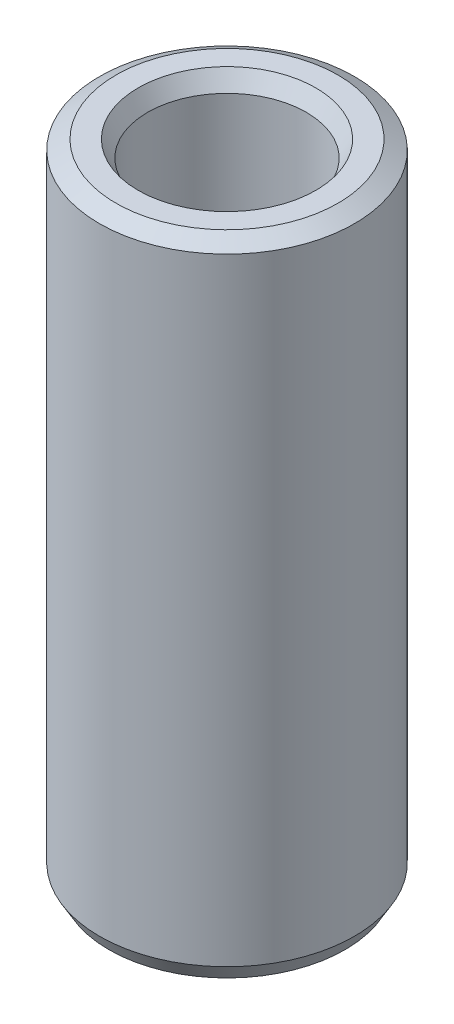
ISO-10303-21;
HEADER;
FILE_DESCRIPTION(('STEP AP214'),'2;1');
FILE_NAME('part.step','',(''),(''),'','','');
FILE_SCHEMA(('AUTOMOTIVE_DESIGN { 1 0 10303 214 1 1 1 1 }'));
ENDSEC;
DATA;
#1=APPLICATION_CONTEXT('core data for automotive mechanical design processes');
#2=APPLICATION_PROTOCOL_DEFINITION('international standard','automotive_design',2000,#1);
#3=PRODUCT_CONTEXT('',#1,'mechanical');
#4=PRODUCT('Part','Part','',(#3));
#5=PRODUCT_RELATED_PRODUCT_CATEGORY('part','',(#4));
#6=PRODUCT_DEFINITION_FORMATION('','',#4);
#7=PRODUCT_DEFINITION_CONTEXT('part definition',#1,'design');
#8=PRODUCT_DEFINITION('design','',#6,#7);
#9=PRODUCT_DEFINITION_SHAPE('','',#8);
#10=(LENGTH_UNIT() NAMED_UNIT(*) SI_UNIT(.MILLI.,.METRE.));
#11=(NAMED_UNIT(*) PLANE_ANGLE_UNIT() SI_UNIT($,.RADIAN.));
#12=(NAMED_UNIT(*) SI_UNIT($,.STERADIAN.) SOLID_ANGLE_UNIT());
#13=UNCERTAINTY_MEASURE_WITH_UNIT(LENGTH_MEASURE(1.E-05),#10,'distance_accuracy_value','');
#14=(GEOMETRIC_REPRESENTATION_CONTEXT(3) GLOBAL_UNCERTAINTY_ASSIGNED_CONTEXT((#13)) GLOBAL_UNIT_ASSIGNED_CONTEXT((#10,
#11,#12)) REPRESENTATION_CONTEXT('',''));
#15=CARTESIAN_POINT('',(0.,0.,0.));
#16=DIRECTION('',(0.,0.,1.));
#17=DIRECTION('',(1.,0.,0.));
#18=AXIS2_PLACEMENT_3D('',#15,#16,#17);
#19=CARTESIAN_POINT('',(0.,252.18787916316,0.));
#20=DIRECTION('',(0.,-1.,0.));
#21=DIRECTION('',(0.,0.,-1.));
#22=AXIS2_PLACEMENT_3D('',#19,#20,#21);
#23=CYLINDRICAL_SURFACE('',#22,50.);
#24=CARTESIAN_POINT('',(0.,6.446711451987,0.));
#25=DIRECTION('',(0.,1.,0.));
#26=DIRECTION('',(0.,0.,1.));
#27=AXIS2_PLACEMENT_3D('',#24,#25,#26);
#28=CIRCLE('',#27,50.);
#29=CARTESIAN_POINT('',(0.,6.446711451987,50.));
#30=VERTEX_POINT('',#29);
#31=EDGE_CURVE('E10',#30,#30,#28,.T.);
#32=ORIENTED_EDGE('',*,*,#31,.T.);
#33=EDGE_LOOP('',(#32));
#34=FACE_BOUND('',#33,.T.);
#35=CARTESIAN_POINT('',(0.,248.465868570967,0.));
#36=DIRECTION('',(0.,1.,0.));
#37=DIRECTION('',(0.,0.,1.));
#38=AXIS2_PLACEMENT_3D('',#35,#36,#37);
#39=CIRCLE('',#38,50.);
#40=CARTESIAN_POINT('',(0.,248.465868570967,-50.));
#41=VERTEX_POINT('',#40);
#42=EDGE_CURVE('E50',#41,#41,#39,.F.);
#43=ORIENTED_EDGE('',*,*,#42,.T.);
#44=EDGE_LOOP('',(#43));
#45=FACE_BOUND('',#44,.T.);
#46=ADVANCED_FACE('F39',(#34,#45),#23,.T.);
#47=CARTESIAN_POINT('',(0.,252.18787916316,0.));
#48=DIRECTION('',(0.,1.,0.));
#49=DIRECTION('',(0.,0.,1.));
#50=AXIS2_PLACEMENT_3D('',#47,#48,#49);
#51=PLANE('',#50);
#52=CARTESIAN_POINT('',(0.,252.18787916316,0.));
#53=DIRECTION('',(0.,1.,0.));
#54=DIRECTION('',(0.,0.,1.));
#55=AXIS2_PLACEMENT_3D('',#52,#53,#54);
#56=CIRCLE('',#55,34.8376289305823);
#57=CARTESIAN_POINT('',(0.,252.18787916316,34.8376289305823));
#58=VERTEX_POINT('',#57);
#59=EDGE_CURVE('E58',#58,#58,#56,.F.);
#60=ORIENTED_EDGE('',*,*,#59,.T.);
#61=EDGE_LOOP('',(#60));
#62=FACE_BOUND('',#61,.T.);
#63=CARTESIAN_POINT('',(0.,252.18787916316,0.));
#64=DIRECTION('',(0.,1.,0.));
#65=DIRECTION('',(0.,0.,1.));
#66=AXIS2_PLACEMENT_3D('',#63,#64,#65);
#67=CIRCLE('',#66,43.553288548013);
#68=CARTESIAN_POINT('',(0.,252.18787916316,-43.553288548013));
#69=VERTEX_POINT('',#68);
#70=EDGE_CURVE('E61',#69,#69,#67,.T.);
#71=ORIENTED_EDGE('',*,*,#70,.T.);
#72=EDGE_LOOP('',(#71));
#73=FACE_BOUND('',#72,.T.);
#74=ADVANCED_FACE('F88',(#62,#73),#51,.T.);
#75=CARTESIAN_POINT('',(0.,0.,0.));
#76=DIRECTION('',(0.,1.,0.));
#77=DIRECTION('',(0.,0.,1.));
#78=AXIS2_PLACEMENT_3D('',#75,#76,#77);
#79=PLANE('',#78);
#80=CARTESIAN_POINT('',(0.,0.,0.));
#81=DIRECTION('',(0.,1.,0.));
#82=DIRECTION('',(0.,0.,1.));
#83=AXIS2_PLACEMENT_3D('',#80,#81,#82);
#84=CIRCLE('',#83,37.5623297903769);
#85=CARTESIAN_POINT('',(0.,0.,37.5623297903769));
#86=VERTEX_POINT('',#85);
#87=EDGE_CURVE('E51',#86,#86,#84,.T.);
#88=ORIENTED_EDGE('',*,*,#87,.T.);
#89=EDGE_LOOP('',(#88));
#90=FACE_BOUND('',#89,.T.);
#91=CARTESIAN_POINT('',(0.,0.,0.));
#92=DIRECTION('',(0.,1.,0.));
#93=DIRECTION('',(0.,0.,1.));
#94=AXIS2_PLACEMENT_3D('',#91,#92,#93);
#95=CIRCLE('',#94,46.2779894078074);
#96=CARTESIAN_POINT('',(0.,0.,46.2779894078074));
#97=VERTEX_POINT('',#96);
#98=EDGE_CURVE('E54',#97,#97,#95,.F.);
#99=ORIENTED_EDGE('',*,*,#98,.T.);
#100=EDGE_LOOP('',(#99));
#101=FACE_BOUND('',#100,.T.);
#102=ADVANCED_FACE('F83',(#90,#101),#79,.F.);
#103=CARTESIAN_POINT('',(0.,252.18787916316,0.));
#104=DIRECTION('',(0.,-1.,0.));
#105=DIRECTION('',(0.,0.,-1.));
#106=AXIS2_PLACEMENT_3D('',#103,#104,#105);
#107=CYLINDRICAL_SURFACE('',#106,31.1156183383899);
#108=CARTESIAN_POINT('',(0.,245.741167711173,0.));
#109=DIRECTION('',(0.,1.,0.));
#110=DIRECTION('',(0.,0.,1.));
#111=AXIS2_PLACEMENT_3D('',#108,#109,#110);
#112=CIRCLE('',#111,31.1156183383899);
#113=CARTESIAN_POINT('',(0.,245.741167711173,31.1156183383899));
#114=VERTEX_POINT('',#113);
#115=EDGE_CURVE('E67',#114,#114,#112,.T.);
#116=ORIENTED_EDGE('',*,*,#115,.T.);
#117=EDGE_LOOP('',(#116));
#118=FACE_BOUND('',#117,.T.);
#119=CARTESIAN_POINT('',(0.,3.72201059219263,0.));
#120=DIRECTION('',(0.,1.,0.));
#121=DIRECTION('',(0.,0.,1.));
#122=AXIS2_PLACEMENT_3D('',#119,#120,#121);
#123=CIRCLE('',#122,31.1156183383899);
#124=CARTESIAN_POINT('',(0.,3.72201059219263,31.1156183383899));
#125=VERTEX_POINT('',#124);
#126=EDGE_CURVE('E69',#125,#125,#123,.F.);
#127=ORIENTED_EDGE('',*,*,#126,.T.);
#128=EDGE_LOOP('',(#127));
#129=FACE_BOUND('',#128,.T.);
#130=ADVANCED_FACE('F71',(#118,#129),#107,.F.);
#131=CARTESIAN_POINT('',(0.,245.741167711173,0.));
#132=DIRECTION('',(0.,1.,0.));
#133=DIRECTION('',(0.,0.,1.));
#134=AXIS2_PLACEMENT_3D('',#131,#132,#133);
#135=CONICAL_SURFACE('',#134,31.1156183383899,0.523598775598296);
#136=ORIENTED_EDGE('',*,*,#59,.F.);
#137=EDGE_LOOP('',(#136));
#138=FACE_BOUND('',#137,.T.);
#139=ORIENTED_EDGE('',*,*,#115,.F.);
#140=EDGE_LOOP('',(#139));
#141=FACE_BOUND('',#140,.T.);
#142=ADVANCED_FACE('F77',(#138,#141),#135,.F.);
#143=CARTESIAN_POINT('',(0.,0.,0.));
#144=DIRECTION('',(0.,-1.,0.));
#145=DIRECTION('',(0.,0.,-1.));
#146=AXIS2_PLACEMENT_3D('',#143,#144,#145);
#147=CONICAL_SURFACE('',#146,37.5623297903769,1.04719755119659);
#148=ORIENTED_EDGE('',*,*,#126,.F.);
#149=EDGE_LOOP('',(#148));
#150=FACE_BOUND('',#149,.T.);
#151=ORIENTED_EDGE('',*,*,#87,.F.);
#152=EDGE_LOOP('',(#151));
#153=FACE_BOUND('',#152,.T.);
#154=ADVANCED_FACE('F73',(#150,#153),#147,.F.);
#155=CARTESIAN_POINT('',(0.,6.446711451987,0.));
#156=DIRECTION('',(0.,1.,0.));
#157=DIRECTION('',(0.,0.,1.));
#158=AXIS2_PLACEMENT_3D('',#155,#156,#157);
#159=CONICAL_SURFACE('',#158,50.,0.523598775598304);
#160=ORIENTED_EDGE('',*,*,#98,.F.);
#161=EDGE_LOOP('',(#160));
#162=FACE_BOUND('',#161,.T.);
#163=ORIENTED_EDGE('',*,*,#31,.F.);
#164=EDGE_LOOP('',(#163));
#165=FACE_BOUND('',#164,.T.);
#166=ADVANCED_FACE('F76',(#162,#165),#159,.T.);
#167=CARTESIAN_POINT('',(0.,252.18787916316,0.));
#168=DIRECTION('',(0.,-1.,0.));
#169=DIRECTION('',(0.,0.,-1.));
#170=AXIS2_PLACEMENT_3D('',#167,#168,#169);
#171=CONICAL_SURFACE('',#170,43.553288548013,1.0471975511966);
#172=CARTESIAN_POINT('',(0.,248.465868570967,-50.));
#173=CARTESIAN_POINT('',(0.,248.504639514636,-49.9328467557085));
#174=CARTESIAN_POINT('',(0.,248.543410458305,-49.865693511417));
#175=CARTESIAN_POINT('',(0.,248.620952345642,-49.7313870228339));
#176=CARTESIAN_POINT('',(0.,248.659723289311,-49.6642337785424));
#177=CARTESIAN_POINT('',(0.,248.737265176648,-49.5299272899593));
#178=CARTESIAN_POINT('',(0.,248.776036120317,-49.4627740456678));
#179=CARTESIAN_POINT('',(0.,248.853578007654,-49.3284675570847));
#180=CARTESIAN_POINT('',(0.,248.892348951323,-49.2613143127932));
#181=CARTESIAN_POINT('',(0.,248.96989083866,-49.1270078242101));
#182=CARTESIAN_POINT('',(0.,249.008661782329,-49.0598545799186));
#183=CARTESIAN_POINT('',(0.,249.086203669666,-48.9255480913355));
#184=CARTESIAN_POINT('',(0.,249.124974613335,-48.858394847044));
#185=CARTESIAN_POINT('',(0.,249.202516500672,-48.7240883584609));
#186=CARTESIAN_POINT('',(0.,249.241287444341,-48.6569351141694));
#187=CARTESIAN_POINT('',(0.,249.318829331678,-48.5226286255863));
#188=CARTESIAN_POINT('',(0.,249.357600275347,-48.4554753812948));
#189=CARTESIAN_POINT('',(0.,249.435142162684,-48.3211688927117));
#190=CARTESIAN_POINT('',(0.,249.473913106353,-48.2540156484202));
#191=CARTESIAN_POINT('',(0.,249.55145499369,-48.1197091598372));
#192=CARTESIAN_POINT('',(0.,249.590225937359,-48.0525559155456));
#193=CARTESIAN_POINT('',(0.,249.667767824696,-47.9182494269626));
#194=CARTESIAN_POINT('',(0.,249.706538768365,-47.851096182671));
#195=CARTESIAN_POINT('',(0.,249.784080655702,-47.716789694088));
#196=CARTESIAN_POINT('',(0.,249.822851599371,-47.6496364497964));
#197=CARTESIAN_POINT('',(0.,249.900393486708,-47.5153299612134));
#198=CARTESIAN_POINT('',(0.,249.939164430377,-47.4481767169218));
#199=CARTESIAN_POINT('',(0.,250.016706317714,-47.3138702283388));
#200=CARTESIAN_POINT('',(0.,250.055477261383,-47.2467169840473));
#201=CARTESIAN_POINT('',(0.,250.13301914872,-47.1124104954642));
#202=CARTESIAN_POINT('',(0.,250.171790092389,-47.0452572511727));
#203=CARTESIAN_POINT('',(0.,250.249331979726,-46.9109507625896));
#204=CARTESIAN_POINT('',(0.,250.288102923395,-46.8437975182981));
#205=CARTESIAN_POINT('',(0.,250.365644810732,-46.709491029715));
#206=CARTESIAN_POINT('',(0.,250.404415754401,-46.6423377854235));
#207=CARTESIAN_POINT('',(0.,250.481957641738,-46.5080312968404));
#208=CARTESIAN_POINT('',(0.,250.520728585407,-46.4408780525489));
#209=CARTESIAN_POINT('',(0.,250.598270472744,-46.3065715639658));
#210=CARTESIAN_POINT('',(0.,250.637041416413,-46.2394183196743));
#211=CARTESIAN_POINT('',(0.,250.71458330375,-46.1051118310912));
#212=CARTESIAN_POINT('',(0.,250.753354247419,-46.0379585867997));
#213=CARTESIAN_POINT('',(0.,250.830896134756,-45.9036520982166));
#214=CARTESIAN_POINT('',(0.,250.869667078425,-45.8364988539251));
#215=CARTESIAN_POINT('',(0.,250.947208965762,-45.702192365342));
#216=CARTESIAN_POINT('',(0.,250.985979909431,-45.6350391210505));
#217=CARTESIAN_POINT('',(0.,251.063521796768,-45.5007326324674));
#218=CARTESIAN_POINT('',(0.,251.102292740437,-45.4335793881759));
#219=CARTESIAN_POINT('',(0.,251.179834627774,-45.2992728995929));
#220=CARTESIAN_POINT('',(0.,251.218605571443,-45.2321196553013));
#221=CARTESIAN_POINT('',(0.,251.29614745878,-45.0978131667183));
#222=CARTESIAN_POINT('',(0.,251.334918402449,-45.0306599224267));
#223=CARTESIAN_POINT('',(0.,251.412460289786,-44.8963534338437));
#224=CARTESIAN_POINT('',(0.,251.451231233455,-44.8292001895521));
#225=CARTESIAN_POINT('',(0.,251.528773120792,-44.6948937009691));
#226=CARTESIAN_POINT('',(0.,251.567544064461,-44.6277404566775));
#227=CARTESIAN_POINT('',(0.,251.645085951798,-44.4934339680945));
#228=CARTESIAN_POINT('',(0.,251.683856895467,-44.4262807238029));
#229=CARTESIAN_POINT('',(0.,251.761398782804,-44.2919742352199));
#230=CARTESIAN_POINT('',(0.,251.800169726473,-44.2248209909283));
#231=CARTESIAN_POINT('',(0.,251.87771161381,-44.0905145023453));
#232=CARTESIAN_POINT('',(0.,251.916482557479,-44.0233612580538));
#233=CARTESIAN_POINT('',(0.,251.994024444816,-43.8890547694707));
#234=CARTESIAN_POINT('',(0.,252.032795388485,-43.8219015251792));
#235=CARTESIAN_POINT('',(0.,252.110337275822,-43.6875950365961));
#236=CARTESIAN_POINT('',(0.,252.149108219491,-43.6204417923046));
#237=CARTESIAN_POINT('',(0.,252.18787916316,-43.553288548013));
#238=B_SPLINE_CURVE_WITH_KNOTS('',3,(#172,#173,#174,#175,#176,#177,#178,#179,#180,#181,#182,
#183,#184,#185,#186,#187,#188,#189,#190,#191,#192,#193,#194,#195,#196,#197,#198,#199,#200,#201,
#202,#203,#204,#205,#206,#207,#208,#209,#210,#211,#212,#213,#214,#215,#216,#217,#218,#219,#220,
#221,#222,#223,#224,#225,#226,#227,#228,#229,#230,#231,#232,#233,#234,#235,#236,#237),
.UNSPECIFIED.,.F.,.F.,(4,2,2,2,2,2,2,2,2,2,2,2,2,2,2,2,2,2,2,2,2,2,2,2,2,2,2,2,2,2,2,2,4),(0.,
0.232625662012023,0.465251324024061,0.697876986036098,0.930502648048129,1.16312831006017,
1.39575397207219,1.62837963408422,1.86100529609626,2.0936309581083,2.32625662012033,
2.55888228213237,2.79150794414439,3.02413360615643,3.25675926816846,3.48938493018048,
3.72201059219253,3.95463625420456,4.1872619162166,4.41988757822862,4.65251324024068,
4.88513890225269,5.11776456426472,5.35039022627677,5.58301588828878,5.81564155030084,
6.04826721231286,6.28089287432488,6.51351853633693,6.74614419834895,6.978769860361,
7.21139552237302,7.44402118438507),.UNSPECIFIED.);
#239=EDGE_CURVE('BSEAM45',#41,#69,#238,.T.);
#240=ORIENTED_EDGE('',*,*,#42,.F.);
#241=ORIENTED_EDGE('',*,*,#70,.F.);
#242=ORIENTED_EDGE('',*,*,#239,.T.);
#243=ORIENTED_EDGE('',*,*,#239,.F.);
#244=EDGE_LOOP('',(#240,#242,#241,#243));
#245=FACE_BOUND('',#244,.T.);
#246=ADVANCED_FACE('F45',(#245),#171,.T.);
#247=CLOSED_SHELL('',(#46,#74,#102,#130,#142,#154,#166,#246));
#248=MANIFOLD_SOLID_BREP('B2',#247);
#249=ADVANCED_BREP_SHAPE_REPRESENTATION('',(#18,#248),#14);
#250=SHAPE_DEFINITION_REPRESENTATION(#9,#249);
ENDSEC;
END-ISO-10303-21;
